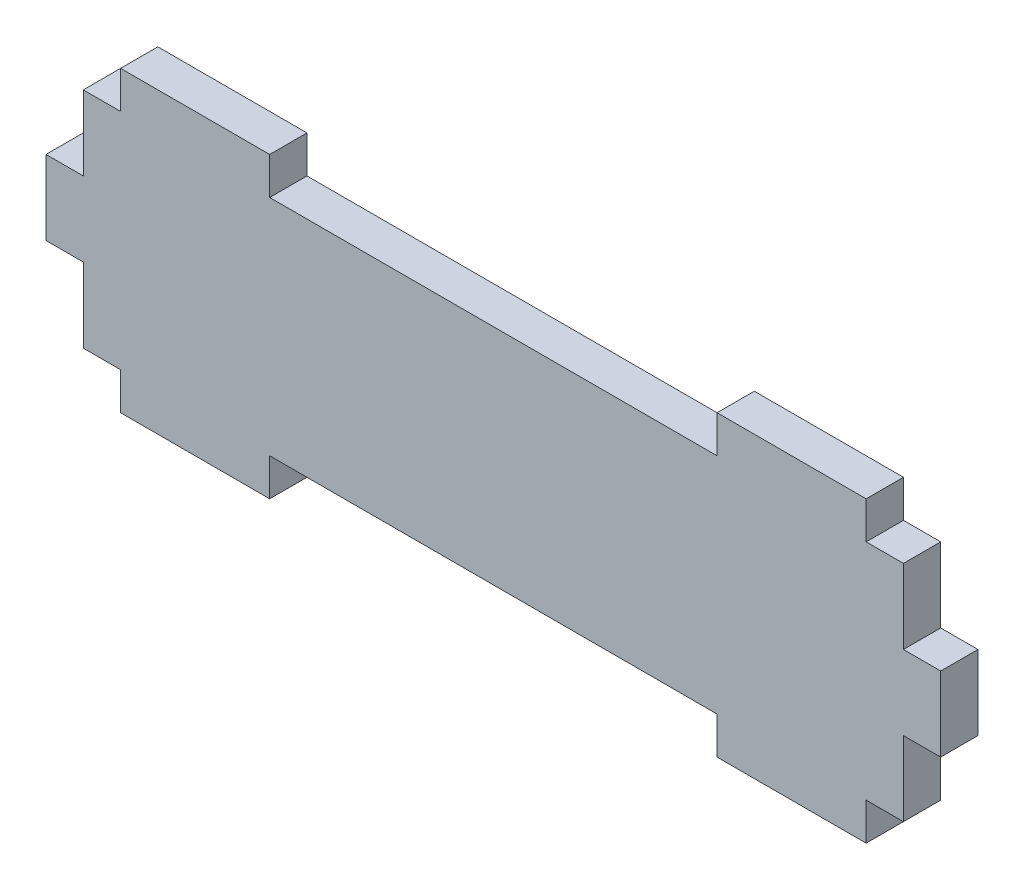
ISO-10303-21;
HEADER;
FILE_DESCRIPTION(('STEP AP214'),'2;1');
FILE_NAME('part.step','',(''),(''),'','','');
FILE_SCHEMA(('AUTOMOTIVE_DESIGN { 1 0 10303 214 1 1 1 1 }'));
ENDSEC;
DATA;
#1=APPLICATION_CONTEXT('core data for automotive mechanical design processes');
#2=APPLICATION_PROTOCOL_DEFINITION('international standard','automotive_design',2000,#1);
#3=PRODUCT_CONTEXT('',#1,'mechanical');
#4=PRODUCT('Part','Part','',(#3));
#5=PRODUCT_RELATED_PRODUCT_CATEGORY('part','',(#4));
#6=PRODUCT_DEFINITION_FORMATION('','',#4);
#7=PRODUCT_DEFINITION_CONTEXT('part definition',#1,'design');
#8=PRODUCT_DEFINITION('design','',#6,#7);
#9=PRODUCT_DEFINITION_SHAPE('','',#8);
#10=(LENGTH_UNIT() NAMED_UNIT(*) SI_UNIT(.MILLI.,.METRE.));
#11=(NAMED_UNIT(*) PLANE_ANGLE_UNIT() SI_UNIT($,.RADIAN.));
#12=(NAMED_UNIT(*) SI_UNIT($,.STERADIAN.) SOLID_ANGLE_UNIT());
#13=UNCERTAINTY_MEASURE_WITH_UNIT(LENGTH_MEASURE(1.E-05),#10,'distance_accuracy_value','');
#14=(GEOMETRIC_REPRESENTATION_CONTEXT(3) GLOBAL_UNCERTAINTY_ASSIGNED_CONTEXT((#13)) GLOBAL_UNIT_ASSIGNED_CONTEXT((#10,
#11,#12)) REPRESENTATION_CONTEXT('',''));
#15=CARTESIAN_POINT('',(0.,0.,0.));
#16=DIRECTION('',(0.,0.,1.));
#17=DIRECTION('',(1.,0.,0.));
#18=AXIS2_PLACEMENT_3D('',#15,#16,#17);
#19=CARTESIAN_POINT('',(12.7,6.35,6.35));
#20=DIRECTION('',(1.,0.,0.));
#21=DIRECTION('',(0.,1.,0.));
#22=AXIS2_PLACEMENT_3D('',#19,#20,#21);
#23=PLANE('',#22);
#24=DIRECTION('',(0.,-1.,0.));
#25=VECTOR('',#24,1.);
#26=CARTESIAN_POINT('',(12.7,6.35,0.));
#27=LINE('',#26,#25);
#28=CARTESIAN_POINT('',(12.7,6.35,0.));
#29=VERTEX_POINT('',#28);
#30=CARTESIAN_POINT('',(12.7,0.,0.));
#31=VERTEX_POINT('',#30);
#32=EDGE_CURVE('E249',#29,#31,#27,.T.);
#33=ORIENTED_EDGE('',*,*,#32,.T.);
#34=DIRECTION('',(0.,0.,-1.));
#35=VECTOR('',#34,1.);
#36=CARTESIAN_POINT('',(12.7,0.,6.35));
#37=LINE('',#36,#35);
#38=CARTESIAN_POINT('',(12.7,0.,6.35));
#39=VERTEX_POINT('',#38);
#40=EDGE_CURVE('E11',#39,#31,#37,.T.);
#41=ORIENTED_EDGE('',*,*,#40,.F.);
#42=DIRECTION('',(0.,-1.,0.));
#43=VECTOR('',#42,1.);
#44=CARTESIAN_POINT('',(12.7,6.35,6.35));
#45=LINE('',#44,#43);
#46=CARTESIAN_POINT('',(12.7,6.35,6.35));
#47=VERTEX_POINT('',#46);
#48=EDGE_CURVE('E303',#47,#39,#45,.T.);
#49=ORIENTED_EDGE('',*,*,#48,.F.);
#50=DIRECTION('',(0.,0.,-1.));
#51=VECTOR('',#50,1.);
#52=CARTESIAN_POINT('',(12.7,6.35,6.35));
#53=LINE('',#52,#51);
#54=EDGE_CURVE('E245',#47,#29,#53,.T.);
#55=ORIENTED_EDGE('',*,*,#54,.T.);
#56=EDGE_LOOP('',(#33,#41,#49,#55));
#57=FACE_BOUND('',#56,.T.);
#58=ADVANCED_FACE('F33',(#57),#23,.F.);
#59=CARTESIAN_POINT('',(12.7,0.,6.35));
#60=DIRECTION('',(0.,1.,0.));
#61=DIRECTION('',(-1.,0.,0.));
#62=AXIS2_PLACEMENT_3D('',#59,#60,#61);
#63=PLANE('',#62);
#64=DIRECTION('',(1.,0.,0.));
#65=VECTOR('',#64,1.);
#66=CARTESIAN_POINT('',(12.7,0.,0.));
#67=LINE('',#66,#65);
#68=CARTESIAN_POINT('',(38.1,0.,0.));
#69=VERTEX_POINT('',#68);
#70=EDGE_CURVE('E252',#31,#69,#67,.T.);
#71=ORIENTED_EDGE('',*,*,#70,.T.);
#72=DIRECTION('',(0.,0.,-1.));
#73=VECTOR('',#72,1.);
#74=CARTESIAN_POINT('',(38.1,0.,6.35));
#75=LINE('',#74,#73);
#76=CARTESIAN_POINT('',(38.1,0.,6.35));
#77=VERTEX_POINT('',#76);
#78=EDGE_CURVE('E41',#77,#69,#75,.T.);
#79=ORIENTED_EDGE('',*,*,#78,.F.);
#80=DIRECTION('',(1.,0.,0.));
#81=VECTOR('',#80,1.);
#82=CARTESIAN_POINT('',(12.7,0.,6.35));
#83=LINE('',#82,#81);
#84=EDGE_CURVE('E152',#39,#77,#83,.T.);
#85=ORIENTED_EDGE('',*,*,#84,.F.);
#86=ORIENTED_EDGE('',*,*,#40,.T.);
#87=EDGE_LOOP('',(#71,#79,#85,#86));
#88=FACE_BOUND('',#87,.T.);
#89=ADVANCED_FACE('F461',(#88),#63,.F.);
#90=CARTESIAN_POINT('',(38.1,6.35,6.35));
#91=DIRECTION('',(-1.,0.,0.));
#92=DIRECTION('',(0.,-1.,0.));
#93=AXIS2_PLACEMENT_3D('',#90,#91,#92);
#94=PLANE('',#93);
#95=DIRECTION('',(0.,1.,0.));
#96=VECTOR('',#95,1.);
#97=CARTESIAN_POINT('',(38.1,6.35,0.));
#98=LINE('',#97,#96);
#99=CARTESIAN_POINT('',(38.1,6.35,0.));
#100=VERTEX_POINT('',#99);
#101=EDGE_CURVE('E254',#69,#100,#98,.T.);
#102=ORIENTED_EDGE('',*,*,#101,.T.);
#103=DIRECTION('',(0.,0.,-1.));
#104=VECTOR('',#103,1.);
#105=CARTESIAN_POINT('',(38.1,6.35,6.35));
#106=LINE('',#105,#104);
#107=CARTESIAN_POINT('',(38.1,6.35,6.35));
#108=VERTEX_POINT('',#107);
#109=EDGE_CURVE('E370',#108,#100,#106,.T.);
#110=ORIENTED_EDGE('',*,*,#109,.F.);
#111=DIRECTION('',(0.,1.,0.));
#112=VECTOR('',#111,1.);
#113=CARTESIAN_POINT('',(38.1,6.35,6.35));
#114=LINE('',#113,#112);
#115=EDGE_CURVE('E378',#77,#108,#114,.T.);
#116=ORIENTED_EDGE('',*,*,#115,.F.);
#117=ORIENTED_EDGE('',*,*,#78,.T.);
#118=EDGE_LOOP('',(#102,#110,#116,#117));
#119=FACE_BOUND('',#118,.T.);
#120=ADVANCED_FACE('F376',(#119),#94,.F.);
#121=CARTESIAN_POINT('',(38.1,6.35,6.35));
#122=DIRECTION('',(0.,1.,0.));
#123=DIRECTION('',(0.,0.,1.));
#124=AXIS2_PLACEMENT_3D('',#121,#122,#123);
#125=PLANE('',#124);
#126=DIRECTION('',(1.,0.,0.));
#127=VECTOR('',#126,1.);
#128=CARTESIAN_POINT('',(38.1,6.35,0.));
#129=LINE('',#128,#127);
#130=CARTESIAN_POINT('',(114.3,6.35,0.));
#131=VERTEX_POINT('',#130);
#132=EDGE_CURVE('E256',#100,#131,#129,.T.);
#133=ORIENTED_EDGE('',*,*,#132,.T.);
#134=DIRECTION('',(0.,0.,-1.));
#135=VECTOR('',#134,1.);
#136=CARTESIAN_POINT('',(114.3,6.35,6.35));
#137=LINE('',#136,#135);
#138=CARTESIAN_POINT('',(114.3,6.35,6.35));
#139=VERTEX_POINT('',#138);
#140=EDGE_CURVE('E367',#139,#131,#137,.T.);
#141=ORIENTED_EDGE('',*,*,#140,.F.);
#142=DIRECTION('',(1.,0.,0.));
#143=VECTOR('',#142,1.);
#144=CARTESIAN_POINT('',(38.1,6.35,6.35));
#145=LINE('',#144,#143);
#146=EDGE_CURVE('E396',#108,#139,#145,.T.);
#147=ORIENTED_EDGE('',*,*,#146,.F.);
#148=ORIENTED_EDGE('',*,*,#109,.T.);
#149=EDGE_LOOP('',(#133,#141,#147,#148));
#150=FACE_BOUND('',#149,.T.);
#151=ADVANCED_FACE('F387',(#150),#125,.F.);
#152=CARTESIAN_POINT('',(114.3,6.35,6.35));
#153=DIRECTION('',(1.,0.,0.));
#154=DIRECTION('',(0.,1.,0.));
#155=AXIS2_PLACEMENT_3D('',#152,#153,#154);
#156=PLANE('',#155);
#157=DIRECTION('',(0.,-1.,0.));
#158=VECTOR('',#157,1.);
#159=CARTESIAN_POINT('',(114.3,6.35,0.));
#160=LINE('',#159,#158);
#161=CARTESIAN_POINT('',(114.3,0.,0.));
#162=VERTEX_POINT('',#161);
#163=EDGE_CURVE('E258',#131,#162,#160,.T.);
#164=ORIENTED_EDGE('',*,*,#163,.T.);
#165=DIRECTION('',(0.,0.,-1.));
#166=VECTOR('',#165,1.);
#167=CARTESIAN_POINT('',(114.3,0.,6.35));
#168=LINE('',#167,#166);
#169=CARTESIAN_POINT('',(114.3,0.,6.35));
#170=VERTEX_POINT('',#169);
#171=EDGE_CURVE('E364',#170,#162,#168,.T.);
#172=ORIENTED_EDGE('',*,*,#171,.F.);
#173=DIRECTION('',(0.,-1.,0.));
#174=VECTOR('',#173,1.);
#175=CARTESIAN_POINT('',(114.3,6.35,6.35));
#176=LINE('',#175,#174);
#177=EDGE_CURVE('E393',#139,#170,#176,.T.);
#178=ORIENTED_EDGE('',*,*,#177,.F.);
#179=ORIENTED_EDGE('',*,*,#140,.T.);
#180=EDGE_LOOP('',(#164,#172,#178,#179));
#181=FACE_BOUND('',#180,.T.);
#182=ADVANCED_FACE('F391',(#181),#156,.F.);
#183=CARTESIAN_POINT('',(114.3,0.,6.35));
#184=DIRECTION('',(0.,1.,0.));
#185=DIRECTION('',(-1.,0.,0.));
#186=AXIS2_PLACEMENT_3D('',#183,#184,#185);
#187=PLANE('',#186);
#188=DIRECTION('',(1.,0.,0.));
#189=VECTOR('',#188,1.);
#190=CARTESIAN_POINT('',(114.3,0.,0.));
#191=LINE('',#190,#189);
#192=CARTESIAN_POINT('',(139.7,0.,0.));
#193=VERTEX_POINT('',#192);
#194=EDGE_CURVE('E260',#162,#193,#191,.T.);
#195=ORIENTED_EDGE('',*,*,#194,.T.);
#196=DIRECTION('',(0.,0.,-1.));
#197=VECTOR('',#196,1.);
#198=CARTESIAN_POINT('',(139.7,0.,6.35));
#199=LINE('',#198,#197);
#200=CARTESIAN_POINT('',(139.7,0.,6.35));
#201=VERTEX_POINT('',#200);
#202=EDGE_CURVE('E361',#201,#193,#199,.T.);
#203=ORIENTED_EDGE('',*,*,#202,.F.);
#204=DIRECTION('',(1.,0.,0.));
#205=VECTOR('',#204,1.);
#206=CARTESIAN_POINT('',(114.3,0.,6.35));
#207=LINE('',#206,#205);
#208=EDGE_CURVE('E395',#170,#201,#207,.T.);
#209=ORIENTED_EDGE('',*,*,#208,.F.);
#210=ORIENTED_EDGE('',*,*,#171,.T.);
#211=EDGE_LOOP('',(#195,#203,#209,#210));
#212=FACE_BOUND('',#211,.T.);
#213=ADVANCED_FACE('F474',(#212),#187,.F.);
#214=CARTESIAN_POINT('',(139.7,6.35,6.35));
#215=DIRECTION('',(-1.,0.,0.));
#216=DIRECTION('',(0.,-1.,0.));
#217=AXIS2_PLACEMENT_3D('',#214,#215,#216);
#218=PLANE('',#217);
#219=DIRECTION('',(0.,1.,0.));
#220=VECTOR('',#219,1.);
#221=CARTESIAN_POINT('',(139.7,6.35,0.));
#222=LINE('',#221,#220);
#223=CARTESIAN_POINT('',(139.7,6.35,0.));
#224=VERTEX_POINT('',#223);
#225=EDGE_CURVE('E262',#193,#224,#222,.T.);
#226=ORIENTED_EDGE('',*,*,#225,.T.);
#227=DIRECTION('',(0.,0.,-1.));
#228=VECTOR('',#227,1.);
#229=CARTESIAN_POINT('',(139.7,6.35,6.35));
#230=LINE('',#229,#228);
#231=CARTESIAN_POINT('',(139.7,6.35,6.35));
#232=VERTEX_POINT('',#231);
#233=EDGE_CURVE('E358',#232,#224,#230,.T.);
#234=ORIENTED_EDGE('',*,*,#233,.F.);
#235=DIRECTION('',(0.,1.,0.));
#236=VECTOR('',#235,1.);
#237=CARTESIAN_POINT('',(139.7,6.35,6.35));
#238=LINE('',#237,#236);
#239=EDGE_CURVE('E398',#201,#232,#238,.T.);
#240=ORIENTED_EDGE('',*,*,#239,.F.);
#241=ORIENTED_EDGE('',*,*,#202,.T.);
#242=EDGE_LOOP('',(#226,#234,#240,#241));
#243=FACE_BOUND('',#242,.T.);
#244=ADVANCED_FACE('F477',(#243),#218,.F.);
#245=CARTESIAN_POINT('',(139.7,6.35,6.35));
#246=DIRECTION('',(0.,1.,0.));
#247=DIRECTION('',(0.,0.,1.));
#248=AXIS2_PLACEMENT_3D('',#245,#246,#247);
#249=PLANE('',#248);
#250=DIRECTION('',(1.,0.,0.));
#251=VECTOR('',#250,1.);
#252=CARTESIAN_POINT('',(139.7,6.35,0.));
#253=LINE('',#252,#251);
#254=CARTESIAN_POINT('',(146.05,6.35,0.));
#255=VERTEX_POINT('',#254);
#256=EDGE_CURVE('E264',#224,#255,#253,.T.);
#257=ORIENTED_EDGE('',*,*,#256,.T.);
#258=DIRECTION('',(0.,0.,-1.));
#259=VECTOR('',#258,1.);
#260=CARTESIAN_POINT('',(146.05,6.35,6.35));
#261=LINE('',#260,#259);
#262=CARTESIAN_POINT('',(146.05,6.35,6.35));
#263=VERTEX_POINT('',#262);
#264=EDGE_CURVE('E355',#263,#255,#261,.T.);
#265=ORIENTED_EDGE('',*,*,#264,.F.);
#266=DIRECTION('',(1.,0.,0.));
#267=VECTOR('',#266,1.);
#268=CARTESIAN_POINT('',(139.7,6.35,6.35));
#269=LINE('',#268,#267);
#270=EDGE_CURVE('E404',#232,#263,#269,.T.);
#271=ORIENTED_EDGE('',*,*,#270,.F.);
#272=ORIENTED_EDGE('',*,*,#233,.T.);
#273=EDGE_LOOP('',(#257,#265,#271,#272));
#274=FACE_BOUND('',#273,.T.);
#275=ADVANCED_FACE('F481',(#274),#249,.F.);
#276=CARTESIAN_POINT('',(146.05,19.05,6.35));
#277=DIRECTION('',(-1.,0.,0.));
#278=DIRECTION('',(0.,0.,1.));
#279=AXIS2_PLACEMENT_3D('',#276,#277,#278);
#280=PLANE('',#279);
#281=DIRECTION('',(0.,1.,0.));
#282=VECTOR('',#281,1.);
#283=CARTESIAN_POINT('',(146.05,19.05,0.));
#284=LINE('',#283,#282);
#285=CARTESIAN_POINT('',(146.05,19.05,0.));
#286=VERTEX_POINT('',#285);
#287=EDGE_CURVE('E266',#255,#286,#284,.T.);
#288=ORIENTED_EDGE('',*,*,#287,.T.);
#289=DIRECTION('',(0.,0.,-1.));
#290=VECTOR('',#289,1.);
#291=CARTESIAN_POINT('',(146.05,19.05,6.35));
#292=LINE('',#291,#290);
#293=CARTESIAN_POINT('',(146.05,19.05,6.35));
#294=VERTEX_POINT('',#293);
#295=EDGE_CURVE('E352',#294,#286,#292,.T.);
#296=ORIENTED_EDGE('',*,*,#295,.F.);
#297=DIRECTION('',(0.,1.,0.));
#298=VECTOR('',#297,1.);
#299=CARTESIAN_POINT('',(146.05,19.05,6.35));
#300=LINE('',#299,#298);
#301=EDGE_CURVE('E406',#263,#294,#300,.T.);
#302=ORIENTED_EDGE('',*,*,#301,.F.);
#303=ORIENTED_EDGE('',*,*,#264,.T.);
#304=EDGE_LOOP('',(#288,#296,#302,#303));
#305=FACE_BOUND('',#304,.T.);
#306=ADVANCED_FACE('F485',(#305),#280,.F.);
#307=CARTESIAN_POINT('',(146.05,19.05,6.35));
#308=DIRECTION('',(0.,1.,0.));
#309=DIRECTION('',(0.,0.,1.));
#310=AXIS2_PLACEMENT_3D('',#307,#308,#309);
#311=PLANE('',#310);
#312=DIRECTION('',(1.,0.,0.));
#313=VECTOR('',#312,1.);
#314=CARTESIAN_POINT('',(146.05,19.05,0.));
#315=LINE('',#314,#313);
#316=CARTESIAN_POINT('',(152.4,19.05,0.));
#317=VERTEX_POINT('',#316);
#318=EDGE_CURVE('E268',#286,#317,#315,.T.);
#319=ORIENTED_EDGE('',*,*,#318,.T.);
#320=DIRECTION('',(0.,0.,-1.));
#321=VECTOR('',#320,1.);
#322=CARTESIAN_POINT('',(152.4,19.05,6.35));
#323=LINE('',#322,#321);
#324=CARTESIAN_POINT('',(152.4,19.05,6.35));
#325=VERTEX_POINT('',#324);
#326=EDGE_CURVE('E349',#325,#317,#323,.T.);
#327=ORIENTED_EDGE('',*,*,#326,.F.);
#328=DIRECTION('',(1.,0.,0.));
#329=VECTOR('',#328,1.);
#330=CARTESIAN_POINT('',(146.05,19.05,6.35));
#331=LINE('',#330,#329);
#332=EDGE_CURVE('E408',#294,#325,#331,.T.);
#333=ORIENTED_EDGE('',*,*,#332,.F.);
#334=ORIENTED_EDGE('',*,*,#295,.T.);
#335=EDGE_LOOP('',(#319,#327,#333,#334));
#336=FACE_BOUND('',#335,.T.);
#337=ADVANCED_FACE('F489',(#336),#311,.F.);
#338=CARTESIAN_POINT('',(152.4,31.75,6.35));
#339=DIRECTION('',(-1.,0.,0.));
#340=DIRECTION('',(0.,0.,1.));
#341=AXIS2_PLACEMENT_3D('',#338,#339,#340);
#342=PLANE('',#341);
#343=DIRECTION('',(0.,1.,0.));
#344=VECTOR('',#343,1.);
#345=CARTESIAN_POINT('',(152.4,31.75,0.));
#346=LINE('',#345,#344);
#347=CARTESIAN_POINT('',(152.4,31.75,0.));
#348=VERTEX_POINT('',#347);
#349=EDGE_CURVE('E270',#317,#348,#346,.T.);
#350=ORIENTED_EDGE('',*,*,#349,.T.);
#351=DIRECTION('',(0.,0.,-1.));
#352=VECTOR('',#351,1.);
#353=CARTESIAN_POINT('',(152.4,31.75,6.35));
#354=LINE('',#353,#352);
#355=CARTESIAN_POINT('',(152.4,31.75,6.35));
#356=VERTEX_POINT('',#355);
#357=EDGE_CURVE('E346',#356,#348,#354,.T.);
#358=ORIENTED_EDGE('',*,*,#357,.F.);
#359=DIRECTION('',(0.,1.,0.));
#360=VECTOR('',#359,1.);
#361=CARTESIAN_POINT('',(152.4,31.75,6.35));
#362=LINE('',#361,#360);
#363=EDGE_CURVE('E410',#325,#356,#362,.T.);
#364=ORIENTED_EDGE('',*,*,#363,.F.);
#365=ORIENTED_EDGE('',*,*,#326,.T.);
#366=EDGE_LOOP('',(#350,#358,#364,#365));
#367=FACE_BOUND('',#366,.T.);
#368=ADVANCED_FACE('F493',(#367),#342,.F.);
#369=CARTESIAN_POINT('',(146.05,31.75,6.35));
#370=DIRECTION('',(0.,-1.,0.));
#371=DIRECTION('',(0.,0.,-1.));
#372=AXIS2_PLACEMENT_3D('',#369,#370,#371);
#373=PLANE('',#372);
#374=DIRECTION('',(-1.,0.,0.));
#375=VECTOR('',#374,1.);
#376=CARTESIAN_POINT('',(146.05,31.75,0.));
#377=LINE('',#376,#375);
#378=CARTESIAN_POINT('',(146.05,31.75,0.));
#379=VERTEX_POINT('',#378);
#380=EDGE_CURVE('E272',#348,#379,#377,.T.);
#381=ORIENTED_EDGE('',*,*,#380,.T.);
#382=DIRECTION('',(0.,0.,-1.));
#383=VECTOR('',#382,1.);
#384=CARTESIAN_POINT('',(146.05,31.75,6.35));
#385=LINE('',#384,#383);
#386=CARTESIAN_POINT('',(146.05,31.75,6.35));
#387=VERTEX_POINT('',#386);
#388=EDGE_CURVE('E343',#387,#379,#385,.T.);
#389=ORIENTED_EDGE('',*,*,#388,.F.);
#390=DIRECTION('',(-1.,0.,0.));
#391=VECTOR('',#390,1.);
#392=CARTESIAN_POINT('',(146.05,31.75,6.35));
#393=LINE('',#392,#391);
#394=EDGE_CURVE('E412',#356,#387,#393,.T.);
#395=ORIENTED_EDGE('',*,*,#394,.F.);
#396=ORIENTED_EDGE('',*,*,#357,.T.);
#397=EDGE_LOOP('',(#381,#389,#395,#396));
#398=FACE_BOUND('',#397,.T.);
#399=ADVANCED_FACE('F497',(#398),#373,.F.);
#400=CARTESIAN_POINT('',(146.05,44.45,6.35));
#401=DIRECTION('',(-1.,0.,0.));
#402=DIRECTION('',(0.,0.,1.));
#403=AXIS2_PLACEMENT_3D('',#400,#401,#402);
#404=PLANE('',#403);
#405=DIRECTION('',(0.,1.,0.));
#406=VECTOR('',#405,1.);
#407=CARTESIAN_POINT('',(146.05,44.45,0.));
#408=LINE('',#407,#406);
#409=CARTESIAN_POINT('',(146.05,44.45,0.));
#410=VERTEX_POINT('',#409);
#411=EDGE_CURVE('E274',#379,#410,#408,.T.);
#412=ORIENTED_EDGE('',*,*,#411,.T.);
#413=DIRECTION('',(0.,0.,-1.));
#414=VECTOR('',#413,1.);
#415=CARTESIAN_POINT('',(146.05,44.45,6.35));
#416=LINE('',#415,#414);
#417=CARTESIAN_POINT('',(146.05,44.45,6.35));
#418=VERTEX_POINT('',#417);
#419=EDGE_CURVE('E340',#418,#410,#416,.T.);
#420=ORIENTED_EDGE('',*,*,#419,.F.);
#421=DIRECTION('',(0.,1.,0.));
#422=VECTOR('',#421,1.);
#423=CARTESIAN_POINT('',(146.05,44.45,6.35));
#424=LINE('',#423,#422);
#425=EDGE_CURVE('E414',#387,#418,#424,.T.);
#426=ORIENTED_EDGE('',*,*,#425,.F.);
#427=ORIENTED_EDGE('',*,*,#388,.T.);
#428=EDGE_LOOP('',(#412,#420,#426,#427));
#429=FACE_BOUND('',#428,.T.);
#430=ADVANCED_FACE('F501',(#429),#404,.F.);
#431=CARTESIAN_POINT('',(139.7,44.45,6.35));
#432=DIRECTION('',(0.,-1.,0.));
#433=DIRECTION('',(0.,0.,-1.));
#434=AXIS2_PLACEMENT_3D('',#431,#432,#433);
#435=PLANE('',#434);
#436=DIRECTION('',(-1.,0.,0.));
#437=VECTOR('',#436,1.);
#438=CARTESIAN_POINT('',(139.7,44.45,0.));
#439=LINE('',#438,#437);
#440=CARTESIAN_POINT('',(139.7,44.45,0.));
#441=VERTEX_POINT('',#440);
#442=EDGE_CURVE('E276',#410,#441,#439,.T.);
#443=ORIENTED_EDGE('',*,*,#442,.T.);
#444=DIRECTION('',(0.,0.,-1.));
#445=VECTOR('',#444,1.);
#446=CARTESIAN_POINT('',(139.7,44.45,6.35));
#447=LINE('',#446,#445);
#448=CARTESIAN_POINT('',(139.7,44.45,6.35));
#449=VERTEX_POINT('',#448);
#450=EDGE_CURVE('E337',#449,#441,#447,.T.);
#451=ORIENTED_EDGE('',*,*,#450,.F.);
#452=DIRECTION('',(-1.,0.,0.));
#453=VECTOR('',#452,1.);
#454=CARTESIAN_POINT('',(139.7,44.45,6.35));
#455=LINE('',#454,#453);
#456=EDGE_CURVE('E416',#418,#449,#455,.T.);
#457=ORIENTED_EDGE('',*,*,#456,.F.);
#458=ORIENTED_EDGE('',*,*,#419,.T.);
#459=EDGE_LOOP('',(#443,#451,#457,#458));
#460=FACE_BOUND('',#459,.T.);
#461=ADVANCED_FACE('F505',(#460),#435,.F.);
#462=CARTESIAN_POINT('',(139.7,44.45,6.35));
#463=DIRECTION('',(-1.,0.,0.));
#464=DIRECTION('',(0.,0.,1.));
#465=AXIS2_PLACEMENT_3D('',#462,#463,#464);
#466=PLANE('',#465);
#467=DIRECTION('',(0.,1.,0.));
#468=VECTOR('',#467,1.);
#469=CARTESIAN_POINT('',(139.7,44.45,0.));
#470=LINE('',#469,#468);
#471=CARTESIAN_POINT('',(139.7,50.8,0.));
#472=VERTEX_POINT('',#471);
#473=EDGE_CURVE('E278',#441,#472,#470,.T.);
#474=ORIENTED_EDGE('',*,*,#473,.T.);
#475=DIRECTION('',(0.,0.,-1.));
#476=VECTOR('',#475,1.);
#477=CARTESIAN_POINT('',(139.7,50.8,6.35));
#478=LINE('',#477,#476);
#479=CARTESIAN_POINT('',(139.7,50.8,6.35));
#480=VERTEX_POINT('',#479);
#481=EDGE_CURVE('E334',#480,#472,#478,.T.);
#482=ORIENTED_EDGE('',*,*,#481,.F.);
#483=DIRECTION('',(0.,1.,0.));
#484=VECTOR('',#483,1.);
#485=CARTESIAN_POINT('',(139.7,44.45,6.35));
#486=LINE('',#485,#484);
#487=EDGE_CURVE('E418',#449,#480,#486,.T.);
#488=ORIENTED_EDGE('',*,*,#487,.F.);
#489=ORIENTED_EDGE('',*,*,#450,.T.);
#490=EDGE_LOOP('',(#474,#482,#488,#489));
#491=FACE_BOUND('',#490,.T.);
#492=ADVANCED_FACE('F509',(#491),#466,.F.);
#493=CARTESIAN_POINT('',(114.3,50.8,6.35));
#494=DIRECTION('',(0.,-1.,0.));
#495=DIRECTION('',(0.,0.,-1.));
#496=AXIS2_PLACEMENT_3D('',#493,#494,#495);
#497=PLANE('',#496);
#498=DIRECTION('',(-1.,0.,0.));
#499=VECTOR('',#498,1.);
#500=CARTESIAN_POINT('',(114.3,50.8,0.));
#501=LINE('',#500,#499);
#502=CARTESIAN_POINT('',(114.3,50.8,0.));
#503=VERTEX_POINT('',#502);
#504=EDGE_CURVE('E280',#472,#503,#501,.T.);
#505=ORIENTED_EDGE('',*,*,#504,.T.);
#506=DIRECTION('',(0.,0.,-1.));
#507=VECTOR('',#506,1.);
#508=CARTESIAN_POINT('',(114.3,50.8,6.35));
#509=LINE('',#508,#507);
#510=CARTESIAN_POINT('',(114.3,50.8,6.35));
#511=VERTEX_POINT('',#510);
#512=EDGE_CURVE('E331',#511,#503,#509,.T.);
#513=ORIENTED_EDGE('',*,*,#512,.F.);
#514=DIRECTION('',(-1.,0.,0.));
#515=VECTOR('',#514,1.);
#516=CARTESIAN_POINT('',(114.3,50.8,6.35));
#517=LINE('',#516,#515);
#518=EDGE_CURVE('E420',#480,#511,#517,.T.);
#519=ORIENTED_EDGE('',*,*,#518,.F.);
#520=ORIENTED_EDGE('',*,*,#481,.T.);
#521=EDGE_LOOP('',(#505,#513,#519,#520));
#522=FACE_BOUND('',#521,.T.);
#523=ADVANCED_FACE('F513',(#522),#497,.F.);
#524=CARTESIAN_POINT('',(114.3,44.45,6.35));
#525=DIRECTION('',(1.,0.,0.));
#526=DIRECTION('',(0.,0.,-1.));
#527=AXIS2_PLACEMENT_3D('',#524,#525,#526);
#528=PLANE('',#527);
#529=DIRECTION('',(0.,-1.,0.));
#530=VECTOR('',#529,1.);
#531=CARTESIAN_POINT('',(114.3,44.45,0.));
#532=LINE('',#531,#530);
#533=CARTESIAN_POINT('',(114.3,44.45,0.));
#534=VERTEX_POINT('',#533);
#535=EDGE_CURVE('E282',#503,#534,#532,.T.);
#536=ORIENTED_EDGE('',*,*,#535,.T.);
#537=DIRECTION('',(0.,0.,-1.));
#538=VECTOR('',#537,1.);
#539=CARTESIAN_POINT('',(114.3,44.45,6.35));
#540=LINE('',#539,#538);
#541=CARTESIAN_POINT('',(114.3,44.45,6.35));
#542=VERTEX_POINT('',#541);
#543=EDGE_CURVE('E328',#542,#534,#540,.T.);
#544=ORIENTED_EDGE('',*,*,#543,.F.);
#545=DIRECTION('',(0.,-1.,0.));
#546=VECTOR('',#545,1.);
#547=CARTESIAN_POINT('',(114.3,44.45,6.35));
#548=LINE('',#547,#546);
#549=EDGE_CURVE('E422',#511,#542,#548,.T.);
#550=ORIENTED_EDGE('',*,*,#549,.F.);
#551=ORIENTED_EDGE('',*,*,#512,.T.);
#552=EDGE_LOOP('',(#536,#544,#550,#551));
#553=FACE_BOUND('',#552,.T.);
#554=ADVANCED_FACE('F517',(#553),#528,.F.);
#555=CARTESIAN_POINT('',(38.1,44.45,6.35));
#556=DIRECTION('',(0.,-1.,0.));
#557=DIRECTION('',(0.,0.,-1.));
#558=AXIS2_PLACEMENT_3D('',#555,#556,#557);
#559=PLANE('',#558);
#560=DIRECTION('',(-1.,0.,0.));
#561=VECTOR('',#560,1.);
#562=CARTESIAN_POINT('',(38.1,44.45,0.));
#563=LINE('',#562,#561);
#564=CARTESIAN_POINT('',(38.1,44.45,0.));
#565=VERTEX_POINT('',#564);
#566=EDGE_CURVE('E284',#534,#565,#563,.T.);
#567=ORIENTED_EDGE('',*,*,#566,.T.);
#568=DIRECTION('',(0.,0.,-1.));
#569=VECTOR('',#568,1.);
#570=CARTESIAN_POINT('',(38.1,44.45,6.35));
#571=LINE('',#570,#569);
#572=CARTESIAN_POINT('',(38.1,44.45,6.35));
#573=VERTEX_POINT('',#572);
#574=EDGE_CURVE('E325',#573,#565,#571,.T.);
#575=ORIENTED_EDGE('',*,*,#574,.F.);
#576=DIRECTION('',(-1.,0.,0.));
#577=VECTOR('',#576,1.);
#578=CARTESIAN_POINT('',(38.1,44.45,6.35));
#579=LINE('',#578,#577);
#580=EDGE_CURVE('E424',#542,#573,#579,.T.);
#581=ORIENTED_EDGE('',*,*,#580,.F.);
#582=ORIENTED_EDGE('',*,*,#543,.T.);
#583=EDGE_LOOP('',(#567,#575,#581,#582));
#584=FACE_BOUND('',#583,.T.);
#585=ADVANCED_FACE('F521',(#584),#559,.F.);
#586=CARTESIAN_POINT('',(38.1,44.45,6.35));
#587=DIRECTION('',(-1.,0.,0.));
#588=DIRECTION('',(0.,0.,1.));
#589=AXIS2_PLACEMENT_3D('',#586,#587,#588);
#590=PLANE('',#589);
#591=DIRECTION('',(0.,1.,0.));
#592=VECTOR('',#591,1.);
#593=CARTESIAN_POINT('',(38.1,44.45,0.));
#594=LINE('',#593,#592);
#595=CARTESIAN_POINT('',(38.1,50.8,0.));
#596=VERTEX_POINT('',#595);
#597=EDGE_CURVE('E286',#565,#596,#594,.T.);
#598=ORIENTED_EDGE('',*,*,#597,.T.);
#599=DIRECTION('',(0.,0.,-1.));
#600=VECTOR('',#599,1.);
#601=CARTESIAN_POINT('',(38.1,50.8,6.35));
#602=LINE('',#601,#600);
#603=CARTESIAN_POINT('',(38.1,50.8,6.35));
#604=VERTEX_POINT('',#603);
#605=EDGE_CURVE('E322',#604,#596,#602,.T.);
#606=ORIENTED_EDGE('',*,*,#605,.F.);
#607=DIRECTION('',(0.,1.,0.));
#608=VECTOR('',#607,1.);
#609=CARTESIAN_POINT('',(38.1,44.45,6.35));
#610=LINE('',#609,#608);
#611=EDGE_CURVE('E426',#573,#604,#610,.T.);
#612=ORIENTED_EDGE('',*,*,#611,.F.);
#613=ORIENTED_EDGE('',*,*,#574,.T.);
#614=EDGE_LOOP('',(#598,#606,#612,#613));
#615=FACE_BOUND('',#614,.T.);
#616=ADVANCED_FACE('F525',(#615),#590,.F.);
#617=CARTESIAN_POINT('',(12.7,50.8,6.35));
#618=DIRECTION('',(0.,-1.,0.));
#619=DIRECTION('',(0.,0.,-1.));
#620=AXIS2_PLACEMENT_3D('',#617,#618,#619);
#621=PLANE('',#620);
#622=DIRECTION('',(-1.,0.,0.));
#623=VECTOR('',#622,1.);
#624=CARTESIAN_POINT('',(12.7,50.8,0.));
#625=LINE('',#624,#623);
#626=CARTESIAN_POINT('',(12.7,50.8,0.));
#627=VERTEX_POINT('',#626);
#628=EDGE_CURVE('E288',#596,#627,#625,.T.);
#629=ORIENTED_EDGE('',*,*,#628,.T.);
#630=DIRECTION('',(0.,0.,-1.));
#631=VECTOR('',#630,1.);
#632=CARTESIAN_POINT('',(12.7,50.8,6.35));
#633=LINE('',#632,#631);
#634=CARTESIAN_POINT('',(12.7,50.8,6.35));
#635=VERTEX_POINT('',#634);
#636=EDGE_CURVE('E319',#635,#627,#633,.T.);
#637=ORIENTED_EDGE('',*,*,#636,.F.);
#638=DIRECTION('',(-1.,0.,0.));
#639=VECTOR('',#638,1.);
#640=CARTESIAN_POINT('',(12.7,50.8,6.35));
#641=LINE('',#640,#639);
#642=EDGE_CURVE('E428',#604,#635,#641,.T.);
#643=ORIENTED_EDGE('',*,*,#642,.F.);
#644=ORIENTED_EDGE('',*,*,#605,.T.);
#645=EDGE_LOOP('',(#629,#637,#643,#644));
#646=FACE_BOUND('',#645,.T.);
#647=ADVANCED_FACE('F529',(#646),#621,.F.);
#648=CARTESIAN_POINT('',(12.7,44.45,6.35));
#649=DIRECTION('',(1.,0.,0.));
#650=DIRECTION('',(0.,0.,-1.));
#651=AXIS2_PLACEMENT_3D('',#648,#649,#650);
#652=PLANE('',#651);
#653=DIRECTION('',(0.,-1.,0.));
#654=VECTOR('',#653,1.);
#655=CARTESIAN_POINT('',(12.7,44.45,0.));
#656=LINE('',#655,#654);
#657=CARTESIAN_POINT('',(12.7,44.45,0.));
#658=VERTEX_POINT('',#657);
#659=EDGE_CURVE('E290',#627,#658,#656,.T.);
#660=ORIENTED_EDGE('',*,*,#659,.T.);
#661=DIRECTION('',(0.,0.,-1.));
#662=VECTOR('',#661,1.);
#663=CARTESIAN_POINT('',(12.7,44.45,6.35));
#664=LINE('',#663,#662);
#665=CARTESIAN_POINT('',(12.7,44.45,6.35));
#666=VERTEX_POINT('',#665);
#667=EDGE_CURVE('E316',#666,#658,#664,.T.);
#668=ORIENTED_EDGE('',*,*,#667,.F.);
#669=DIRECTION('',(0.,-1.,0.));
#670=VECTOR('',#669,1.);
#671=CARTESIAN_POINT('',(12.7,44.45,6.35));
#672=LINE('',#671,#670);
#673=EDGE_CURVE('E430',#635,#666,#672,.T.);
#674=ORIENTED_EDGE('',*,*,#673,.F.);
#675=ORIENTED_EDGE('',*,*,#636,.T.);
#676=EDGE_LOOP('',(#660,#668,#674,#675));
#677=FACE_BOUND('',#676,.T.);
#678=ADVANCED_FACE('F533',(#677),#652,.F.);
#679=CARTESIAN_POINT('',(6.35,44.45,6.35));
#680=DIRECTION('',(0.,-1.,0.));
#681=DIRECTION('',(0.,0.,-1.));
#682=AXIS2_PLACEMENT_3D('',#679,#680,#681);
#683=PLANE('',#682);
#684=DIRECTION('',(-1.,0.,0.));
#685=VECTOR('',#684,1.);
#686=CARTESIAN_POINT('',(6.35,44.45,0.));
#687=LINE('',#686,#685);
#688=CARTESIAN_POINT('',(6.35,44.45,0.));
#689=VERTEX_POINT('',#688);
#690=EDGE_CURVE('E292',#658,#689,#687,.T.);
#691=ORIENTED_EDGE('',*,*,#690,.T.);
#692=DIRECTION('',(0.,0.,-1.));
#693=VECTOR('',#692,1.);
#694=CARTESIAN_POINT('',(6.35,44.45,6.35));
#695=LINE('',#694,#693);
#696=CARTESIAN_POINT('',(6.35,44.45,6.35));
#697=VERTEX_POINT('',#696);
#698=EDGE_CURVE('E313',#697,#689,#695,.T.);
#699=ORIENTED_EDGE('',*,*,#698,.F.);
#700=DIRECTION('',(-1.,0.,0.));
#701=VECTOR('',#700,1.);
#702=CARTESIAN_POINT('',(6.35,44.45,6.35));
#703=LINE('',#702,#701);
#704=EDGE_CURVE('E432',#666,#697,#703,.T.);
#705=ORIENTED_EDGE('',*,*,#704,.F.);
#706=ORIENTED_EDGE('',*,*,#667,.T.);
#707=EDGE_LOOP('',(#691,#699,#705,#706));
#708=FACE_BOUND('',#707,.T.);
#709=ADVANCED_FACE('F537',(#708),#683,.F.);
#710=CARTESIAN_POINT('',(6.35,44.45,6.35));
#711=DIRECTION('',(1.,0.,0.));
#712=DIRECTION('',(0.,0.,-1.));
#713=AXIS2_PLACEMENT_3D('',#710,#711,#712);
#714=PLANE('',#713);
#715=DIRECTION('',(0.,-1.,0.));
#716=VECTOR('',#715,1.);
#717=CARTESIAN_POINT('',(6.35,44.45,0.));
#718=LINE('',#717,#716);
#719=CARTESIAN_POINT('',(6.35,31.75,0.));
#720=VERTEX_POINT('',#719);
#721=EDGE_CURVE('E294',#689,#720,#718,.T.);
#722=ORIENTED_EDGE('',*,*,#721,.T.);
#723=DIRECTION('',(0.,0.,-1.));
#724=VECTOR('',#723,1.);
#725=CARTESIAN_POINT('',(6.35,31.75,6.35));
#726=LINE('',#725,#724);
#727=CARTESIAN_POINT('',(6.35,31.75,6.35));
#728=VERTEX_POINT('',#727);
#729=EDGE_CURVE('E310',#728,#720,#726,.T.);
#730=ORIENTED_EDGE('',*,*,#729,.F.);
#731=DIRECTION('',(0.,-1.,0.));
#732=VECTOR('',#731,1.);
#733=CARTESIAN_POINT('',(6.35,44.45,6.35));
#734=LINE('',#733,#732);
#735=EDGE_CURVE('E434',#697,#728,#734,.T.);
#736=ORIENTED_EDGE('',*,*,#735,.F.);
#737=ORIENTED_EDGE('',*,*,#698,.T.);
#738=EDGE_LOOP('',(#722,#730,#736,#737));
#739=FACE_BOUND('',#738,.T.);
#740=ADVANCED_FACE('F541',(#739),#714,.F.);
#741=CARTESIAN_POINT('',(0.,31.75,6.35));
#742=DIRECTION('',(0.,-1.,0.));
#743=DIRECTION('',(0.,0.,-1.));
#744=AXIS2_PLACEMENT_3D('',#741,#742,#743);
#745=PLANE('',#744);
#746=DIRECTION('',(-1.,0.,0.));
#747=VECTOR('',#746,1.);
#748=CARTESIAN_POINT('',(0.,31.75,0.));
#749=LINE('',#748,#747);
#750=CARTESIAN_POINT('',(0.,31.75,0.));
#751=VERTEX_POINT('',#750);
#752=EDGE_CURVE('E296',#720,#751,#749,.T.);
#753=ORIENTED_EDGE('',*,*,#752,.T.);
#754=DIRECTION('',(0.,0.,-1.));
#755=VECTOR('',#754,1.);
#756=CARTESIAN_POINT('',(0.,31.75,6.35));
#757=LINE('',#756,#755);
#758=CARTESIAN_POINT('',(0.,31.75,6.35));
#759=VERTEX_POINT('',#758);
#760=EDGE_CURVE('E307',#759,#751,#757,.T.);
#761=ORIENTED_EDGE('',*,*,#760,.F.);
#762=DIRECTION('',(-1.,0.,0.));
#763=VECTOR('',#762,1.);
#764=CARTESIAN_POINT('',(0.,31.75,6.35));
#765=LINE('',#764,#763);
#766=EDGE_CURVE('E436',#728,#759,#765,.T.);
#767=ORIENTED_EDGE('',*,*,#766,.F.);
#768=ORIENTED_EDGE('',*,*,#729,.T.);
#769=EDGE_LOOP('',(#753,#761,#767,#768));
#770=FACE_BOUND('',#769,.T.);
#771=ADVANCED_FACE('F442',(#770),#745,.F.);
#772=CARTESIAN_POINT('',(0.,31.75,6.35));
#773=DIRECTION('',(1.,0.,0.));
#774=DIRECTION('',(0.,1.,0.));
#775=AXIS2_PLACEMENT_3D('',#772,#773,#774);
#776=PLANE('',#775);
#777=DIRECTION('',(0.,-1.,0.));
#778=VECTOR('',#777,1.);
#779=CARTESIAN_POINT('',(0.,31.75,0.));
#780=LINE('',#779,#778);
#781=CARTESIAN_POINT('',(0.,19.05,0.));
#782=VERTEX_POINT('',#781);
#783=EDGE_CURVE('E298',#751,#782,#780,.T.);
#784=ORIENTED_EDGE('',*,*,#783,.T.);
#785=DIRECTION('',(0.,0.,-1.));
#786=VECTOR('',#785,1.);
#787=CARTESIAN_POINT('',(0.,19.05,6.35));
#788=LINE('',#787,#786);
#789=CARTESIAN_POINT('',(0.,19.05,6.35));
#790=VERTEX_POINT('',#789);
#791=EDGE_CURVE('E240',#790,#782,#788,.T.);
#792=ORIENTED_EDGE('',*,*,#791,.F.);
#793=DIRECTION('',(0.,-1.,0.));
#794=VECTOR('',#793,1.);
#795=CARTESIAN_POINT('',(0.,31.75,6.35));
#796=LINE('',#795,#794);
#797=EDGE_CURVE('E231',#759,#790,#796,.T.);
#798=ORIENTED_EDGE('',*,*,#797,.F.);
#799=ORIENTED_EDGE('',*,*,#760,.T.);
#800=EDGE_LOOP('',(#784,#792,#798,#799));
#801=FACE_BOUND('',#800,.T.);
#802=ADVANCED_FACE('F446',(#801),#776,.F.);
#803=CARTESIAN_POINT('',(0.,19.05,6.35));
#804=DIRECTION('',(0.,1.,0.));
#805=DIRECTION('',(0.,0.,1.));
#806=AXIS2_PLACEMENT_3D('',#803,#804,#805);
#807=PLANE('',#806);
#808=DIRECTION('',(1.,0.,0.));
#809=VECTOR('',#808,1.);
#810=CARTESIAN_POINT('',(0.,19.05,0.));
#811=LINE('',#810,#809);
#812=CARTESIAN_POINT('',(6.35,19.05,0.));
#813=VERTEX_POINT('',#812);
#814=EDGE_CURVE('E239',#782,#813,#811,.T.);
#815=ORIENTED_EDGE('',*,*,#814,.T.);
#816=DIRECTION('',(0.,0.,-1.));
#817=VECTOR('',#816,1.);
#818=CARTESIAN_POINT('',(6.35,19.05,6.35));
#819=LINE('',#818,#817);
#820=CARTESIAN_POINT('',(6.35,19.05,6.35));
#821=VERTEX_POINT('',#820);
#822=EDGE_CURVE('E236',#821,#813,#819,.T.);
#823=ORIENTED_EDGE('',*,*,#822,.F.);
#824=DIRECTION('',(1.,0.,0.));
#825=VECTOR('',#824,1.);
#826=CARTESIAN_POINT('',(0.,19.05,6.35));
#827=LINE('',#826,#825);
#828=EDGE_CURVE('E225',#790,#821,#827,.T.);
#829=ORIENTED_EDGE('',*,*,#828,.F.);
#830=ORIENTED_EDGE('',*,*,#791,.T.);
#831=EDGE_LOOP('',(#815,#823,#829,#830));
#832=FACE_BOUND('',#831,.T.);
#833=ADVANCED_FACE('F237',(#832),#807,.F.);
#834=CARTESIAN_POINT('',(6.35,19.05,6.35));
#835=DIRECTION('',(1.,0.,0.));
#836=DIRECTION('',(0.,1.,0.));
#837=AXIS2_PLACEMENT_3D('',#834,#835,#836);
#838=PLANE('',#837);
#839=DIRECTION('',(0.,-1.,0.));
#840=VECTOR('',#839,1.);
#841=CARTESIAN_POINT('',(6.35,19.05,0.));
#842=LINE('',#841,#840);
#843=CARTESIAN_POINT('',(6.35,6.35,0.));
#844=VERTEX_POINT('',#843);
#845=EDGE_CURVE('E138',#813,#844,#842,.T.);
#846=ORIENTED_EDGE('',*,*,#845,.T.);
#847=DIRECTION('',(0.,0.,-1.));
#848=VECTOR('',#847,1.);
#849=CARTESIAN_POINT('',(6.35,6.35,6.35));
#850=LINE('',#849,#848);
#851=CARTESIAN_POINT('',(6.35,6.35,6.35));
#852=VERTEX_POINT('',#851);
#853=EDGE_CURVE('E241',#852,#844,#850,.T.);
#854=ORIENTED_EDGE('',*,*,#853,.F.);
#855=DIRECTION('',(0.,-1.,0.));
#856=VECTOR('',#855,1.);
#857=CARTESIAN_POINT('',(6.35,19.05,6.35));
#858=LINE('',#857,#856);
#859=EDGE_CURVE('E229',#821,#852,#858,.T.);
#860=ORIENTED_EDGE('',*,*,#859,.F.);
#861=ORIENTED_EDGE('',*,*,#822,.T.);
#862=EDGE_LOOP('',(#846,#854,#860,#861));
#863=FACE_BOUND('',#862,.T.);
#864=ADVANCED_FACE('F243',(#863),#838,.F.);
#865=CARTESIAN_POINT('',(6.35,6.35,6.35));
#866=DIRECTION('',(0.,1.,0.));
#867=DIRECTION('',(0.,0.,1.));
#868=AXIS2_PLACEMENT_3D('',#865,#866,#867);
#869=PLANE('',#868);
#870=DIRECTION('',(1.,0.,0.));
#871=VECTOR('',#870,1.);
#872=CARTESIAN_POINT('',(6.35,6.35,0.));
#873=LINE('',#872,#871);
#874=EDGE_CURVE('E144',#844,#29,#873,.T.);
#875=ORIENTED_EDGE('',*,*,#874,.T.);
#876=ORIENTED_EDGE('',*,*,#54,.F.);
#877=DIRECTION('',(1.,0.,0.));
#878=VECTOR('',#877,1.);
#879=CARTESIAN_POINT('',(6.35,6.35,6.35));
#880=LINE('',#879,#878);
#881=EDGE_CURVE('E49',#852,#47,#880,.T.);
#882=ORIENTED_EDGE('',*,*,#881,.F.);
#883=ORIENTED_EDGE('',*,*,#853,.T.);
#884=EDGE_LOOP('',(#875,#876,#882,#883));
#885=FACE_BOUND('',#884,.T.);
#886=ADVANCED_FACE('F450',(#885),#869,.F.);
#887=CARTESIAN_POINT('',(0.,0.,6.35));
#888=DIRECTION('',(0.,0.,1.));
#889=DIRECTION('',(1.,0.,0.));
#890=AXIS2_PLACEMENT_3D('',#887,#888,#889);
#891=PLANE('',#890);
#892=ORIENTED_EDGE('',*,*,#48,.T.);
#893=ORIENTED_EDGE('',*,*,#84,.T.);
#894=ORIENTED_EDGE('',*,*,#115,.T.);
#895=ORIENTED_EDGE('',*,*,#146,.T.);
#896=ORIENTED_EDGE('',*,*,#177,.T.);
#897=ORIENTED_EDGE('',*,*,#208,.T.);
#898=ORIENTED_EDGE('',*,*,#239,.T.);
#899=ORIENTED_EDGE('',*,*,#270,.T.);
#900=ORIENTED_EDGE('',*,*,#301,.T.);
#901=ORIENTED_EDGE('',*,*,#332,.T.);
#902=ORIENTED_EDGE('',*,*,#363,.T.);
#903=ORIENTED_EDGE('',*,*,#394,.T.);
#904=ORIENTED_EDGE('',*,*,#425,.T.);
#905=ORIENTED_EDGE('',*,*,#456,.T.);
#906=ORIENTED_EDGE('',*,*,#487,.T.);
#907=ORIENTED_EDGE('',*,*,#518,.T.);
#908=ORIENTED_EDGE('',*,*,#549,.T.);
#909=ORIENTED_EDGE('',*,*,#580,.T.);
#910=ORIENTED_EDGE('',*,*,#611,.T.);
#911=ORIENTED_EDGE('',*,*,#642,.T.);
#912=ORIENTED_EDGE('',*,*,#673,.T.);
#913=ORIENTED_EDGE('',*,*,#704,.T.);
#914=ORIENTED_EDGE('',*,*,#735,.T.);
#915=ORIENTED_EDGE('',*,*,#766,.T.);
#916=ORIENTED_EDGE('',*,*,#797,.T.);
#917=ORIENTED_EDGE('',*,*,#828,.T.);
#918=ORIENTED_EDGE('',*,*,#859,.T.);
#919=ORIENTED_EDGE('',*,*,#881,.T.);
#920=EDGE_LOOP('',(#892,#893,#894,#895,#896,#897,#898,#899,#900,#901,#902,#903,#904,#905,#906,
#907,#908,#909,#910,#911,#912,#913,#914,#915,#916,#917,#918,#919));
#921=FACE_BOUND('',#920,.T.);
#922=ADVANCED_FACE('F227',(#921),#891,.T.);
#923=CARTESIAN_POINT('',(0.,0.,0.));
#924=DIRECTION('',(0.,0.,1.));
#925=DIRECTION('',(1.,0.,0.));
#926=AXIS2_PLACEMENT_3D('',#923,#924,#925);
#927=PLANE('',#926);
#928=ORIENTED_EDGE('',*,*,#32,.F.);
#929=ORIENTED_EDGE('',*,*,#874,.F.);
#930=ORIENTED_EDGE('',*,*,#845,.F.);
#931=ORIENTED_EDGE('',*,*,#814,.F.);
#932=ORIENTED_EDGE('',*,*,#783,.F.);
#933=ORIENTED_EDGE('',*,*,#752,.F.);
#934=ORIENTED_EDGE('',*,*,#721,.F.);
#935=ORIENTED_EDGE('',*,*,#690,.F.);
#936=ORIENTED_EDGE('',*,*,#659,.F.);
#937=ORIENTED_EDGE('',*,*,#628,.F.);
#938=ORIENTED_EDGE('',*,*,#597,.F.);
#939=ORIENTED_EDGE('',*,*,#566,.F.);
#940=ORIENTED_EDGE('',*,*,#535,.F.);
#941=ORIENTED_EDGE('',*,*,#504,.F.);
#942=ORIENTED_EDGE('',*,*,#473,.F.);
#943=ORIENTED_EDGE('',*,*,#442,.F.);
#944=ORIENTED_EDGE('',*,*,#411,.F.);
#945=ORIENTED_EDGE('',*,*,#380,.F.);
#946=ORIENTED_EDGE('',*,*,#349,.F.);
#947=ORIENTED_EDGE('',*,*,#318,.F.);
#948=ORIENTED_EDGE('',*,*,#287,.F.);
#949=ORIENTED_EDGE('',*,*,#256,.F.);
#950=ORIENTED_EDGE('',*,*,#225,.F.);
#951=ORIENTED_EDGE('',*,*,#194,.F.);
#952=ORIENTED_EDGE('',*,*,#163,.F.);
#953=ORIENTED_EDGE('',*,*,#132,.F.);
#954=ORIENTED_EDGE('',*,*,#101,.F.);
#955=ORIENTED_EDGE('',*,*,#70,.F.);
#956=EDGE_LOOP('',(#928,#929,#930,#931,#932,#933,#934,#935,#936,#937,#938,#939,#940,#941,#942,
#943,#944,#945,#946,#947,#948,#949,#950,#951,#952,#953,#954,#955));
#957=FACE_BOUND('',#956,.T.);
#958=ADVANCED_FACE('F382',(#957),#927,.F.);
#959=CLOSED_SHELL('',(#58,#89,#120,#151,#182,#213,#244,#275,#306,#337,#368,#399,#430,#461,#492,
#523,#554,#585,#616,#647,#678,#709,#740,#771,#802,#833,#864,#886,#922,#958));
#960=MANIFOLD_SOLID_BREP('B2',#959);
#961=ADVANCED_BREP_SHAPE_REPRESENTATION('',(#18,#960),#14);
#962=SHAPE_DEFINITION_REPRESENTATION(#9,#961);
ENDSEC;
END-ISO-10303-21;
